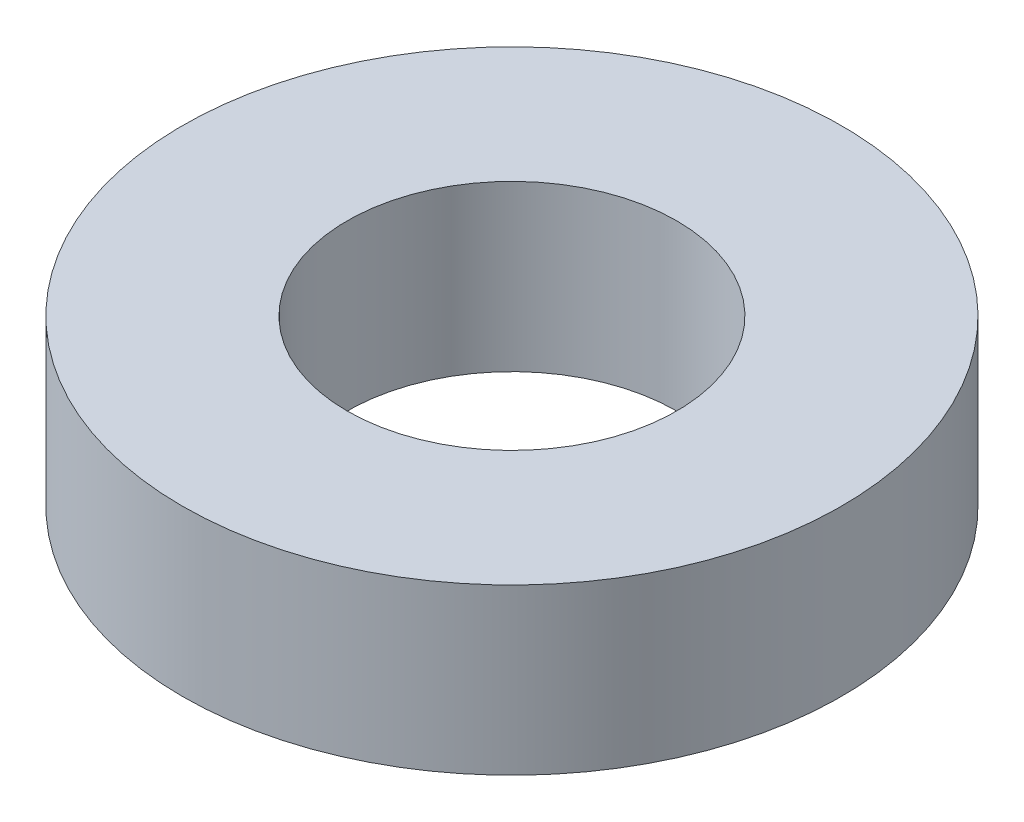
ISO-10303-21;
HEADER;
FILE_DESCRIPTION(('STEP AP214'),'2;1');
FILE_NAME('part.step','',(''),(''),'','','');
FILE_SCHEMA(('AUTOMOTIVE_DESIGN { 1 0 10303 214 1 1 1 1 }'));
ENDSEC;
DATA;
#1=APPLICATION_CONTEXT('core data for automotive mechanical design processes');
#2=APPLICATION_PROTOCOL_DEFINITION('international standard','automotive_design',2000,#1);
#3=PRODUCT_CONTEXT('',#1,'mechanical');
#4=PRODUCT('Part','Part','',(#3));
#5=PRODUCT_RELATED_PRODUCT_CATEGORY('part','',(#4));
#6=PRODUCT_DEFINITION_FORMATION('','',#4);
#7=PRODUCT_DEFINITION_CONTEXT('part definition',#1,'design');
#8=PRODUCT_DEFINITION('design','',#6,#7);
#9=PRODUCT_DEFINITION_SHAPE('','',#8);
#10=(LENGTH_UNIT() NAMED_UNIT(*) SI_UNIT(.MILLI.,.METRE.));
#11=(NAMED_UNIT(*) PLANE_ANGLE_UNIT() SI_UNIT($,.RADIAN.));
#12=(NAMED_UNIT(*) SI_UNIT($,.STERADIAN.) SOLID_ANGLE_UNIT());
#13=UNCERTAINTY_MEASURE_WITH_UNIT(LENGTH_MEASURE(1.E-05),#10,'distance_accuracy_value','');
#14=(GEOMETRIC_REPRESENTATION_CONTEXT(3) GLOBAL_UNCERTAINTY_ASSIGNED_CONTEXT((#13)) GLOBAL_UNIT_ASSIGNED_CONTEXT((#10,
#11,#12)) REPRESENTATION_CONTEXT('',''));
#15=CARTESIAN_POINT('',(0.,0.,0.));
#16=DIRECTION('',(0.,0.,1.));
#17=DIRECTION('',(1.,0.,0.));
#18=AXIS2_PLACEMENT_3D('',#15,#16,#17);
#19=CARTESIAN_POINT('',(0.,25.,0.));
#20=DIRECTION('',(0.,-1.,0.));
#21=DIRECTION('',(0.,0.,-1.));
#22=AXIS2_PLACEMENT_3D('',#19,#20,#21);
#23=CYLINDRICAL_SURFACE('',#22,50.);
#24=CARTESIAN_POINT('',(0.,25.,0.));
#25=DIRECTION('',(0.,1.,0.));
#26=DIRECTION('',(0.,0.,1.));
#27=AXIS2_PLACEMENT_3D('',#24,#25,#26);
#28=CIRCLE('',#27,50.);
#29=CARTESIAN_POINT('',(0.,25.,50.));
#30=VERTEX_POINT('',#29);
#31=EDGE_CURVE('E10',#30,#30,#28,.T.);
#32=ORIENTED_EDGE('',*,*,#31,.F.);
#33=EDGE_LOOP('',(#32));
#34=FACE_BOUND('',#33,.T.);
#35=CARTESIAN_POINT('',(0.,0.,0.));
#36=DIRECTION('',(0.,1.,0.));
#37=DIRECTION('',(0.,0.,1.));
#38=AXIS2_PLACEMENT_3D('',#35,#36,#37);
#39=CIRCLE('',#38,50.);
#40=CARTESIAN_POINT('',(0.,0.,50.));
#41=VERTEX_POINT('',#40);
#42=EDGE_CURVE('E37',#41,#41,#39,.T.);
#43=ORIENTED_EDGE('',*,*,#42,.T.);
#44=EDGE_LOOP('',(#43));
#45=FACE_BOUND('',#44,.T.);
#46=ADVANCED_FACE('F40',(#34,#45),#23,.T.);
#47=CARTESIAN_POINT('',(0.,25.,0.));
#48=DIRECTION('',(0.,1.,0.));
#49=DIRECTION('',(0.,0.,1.));
#50=AXIS2_PLACEMENT_3D('',#47,#48,#49);
#51=PLANE('',#50);
#52=CARTESIAN_POINT('',(0.,25.,0.));
#53=DIRECTION('',(0.,1.,0.));
#54=DIRECTION('',(0.,0.,1.));
#55=AXIS2_PLACEMENT_3D('',#52,#53,#54);
#56=CIRCLE('',#55,25.);
#57=CARTESIAN_POINT('',(0.,25.,25.));
#58=VERTEX_POINT('',#57);
#59=EDGE_CURVE('E50',#58,#58,#56,.T.);
#60=ORIENTED_EDGE('',*,*,#59,.F.);
#61=EDGE_LOOP('',(#60));
#62=FACE_BOUND('',#61,.T.);
#63=ORIENTED_EDGE('',*,*,#31,.T.);
#64=EDGE_LOOP('',(#63));
#65=FACE_BOUND('',#64,.T.);
#66=ADVANCED_FACE('F59',(#62,#65),#51,.T.);
#67=CARTESIAN_POINT('',(0.,0.,0.));
#68=DIRECTION('',(0.,1.,0.));
#69=DIRECTION('',(0.,0.,1.));
#70=AXIS2_PLACEMENT_3D('',#67,#68,#69);
#71=PLANE('',#70);
#72=CARTESIAN_POINT('',(0.,0.,0.));
#73=DIRECTION('',(0.,1.,0.));
#74=DIRECTION('',(0.,0.,1.));
#75=AXIS2_PLACEMENT_3D('',#72,#73,#74);
#76=CIRCLE('',#75,25.);
#77=CARTESIAN_POINT('',(0.,0.,25.));
#78=VERTEX_POINT('',#77);
#79=EDGE_CURVE('E47',#78,#78,#76,.T.);
#80=ORIENTED_EDGE('',*,*,#79,.T.);
#81=EDGE_LOOP('',(#80));
#82=FACE_BOUND('',#81,.T.);
#83=ORIENTED_EDGE('',*,*,#42,.F.);
#84=EDGE_LOOP('',(#83));
#85=FACE_BOUND('',#84,.T.);
#86=ADVANCED_FACE('F58',(#82,#85),#71,.F.);
#87=CARTESIAN_POINT('',(0.,25.,0.));
#88=DIRECTION('',(0.,-1.,0.));
#89=DIRECTION('',(0.,0.,-1.));
#90=AXIS2_PLACEMENT_3D('',#87,#88,#89);
#91=CYLINDRICAL_SURFACE('',#90,25.);
#92=ORIENTED_EDGE('',*,*,#59,.T.);
#93=EDGE_LOOP('',(#92));
#94=FACE_BOUND('',#93,.T.);
#95=ORIENTED_EDGE('',*,*,#79,.F.);
#96=EDGE_LOOP('',(#95));
#97=FACE_BOUND('',#96,.T.);
#98=ADVANCED_FACE('F54',(#94,#97),#91,.F.);
#99=CLOSED_SHELL('',(#46,#66,#86,#98));
#100=MANIFOLD_SOLID_BREP('B2',#99);
#101=ADVANCED_BREP_SHAPE_REPRESENTATION('',(#18,#100),#14);
#102=SHAPE_DEFINITION_REPRESENTATION(#9,#101);
ENDSEC;
END-ISO-10303-21;
